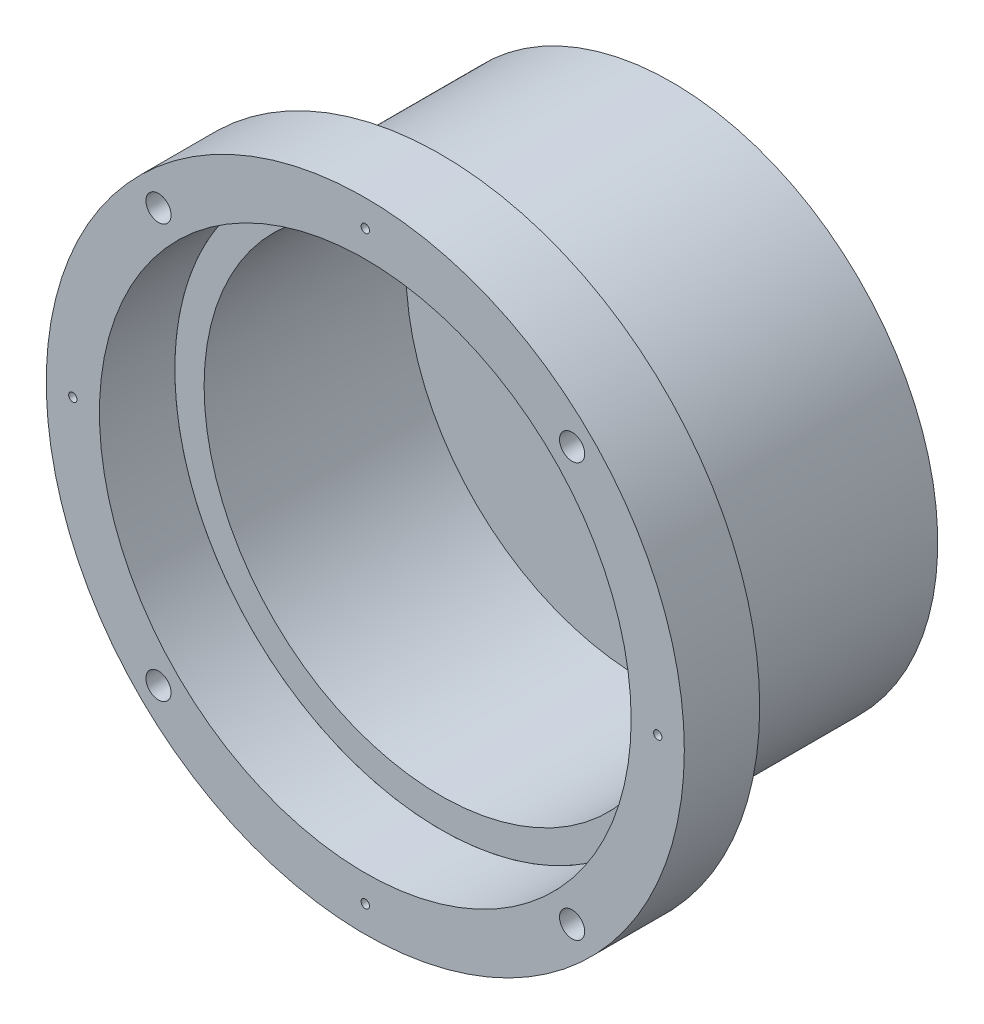
ISO-10303-21;
HEADER;
FILE_DESCRIPTION(('STEP AP214'),'2;1');
FILE_NAME('part.step','',(''),(''),'','','');
FILE_SCHEMA(('AUTOMOTIVE_DESIGN { 1 0 10303 214 1 1 1 1 }'));
ENDSEC;
DATA;
#1=APPLICATION_CONTEXT('core data for automotive mechanical design processes');
#2=APPLICATION_PROTOCOL_DEFINITION('international standard','automotive_design',2000,#1);
#3=PRODUCT_CONTEXT('',#1,'mechanical');
#4=PRODUCT('Part','Part','',(#3));
#5=PRODUCT_RELATED_PRODUCT_CATEGORY('part','',(#4));
#6=PRODUCT_DEFINITION_FORMATION('','',#4);
#7=PRODUCT_DEFINITION_CONTEXT('part definition',#1,'design');
#8=PRODUCT_DEFINITION('design','',#6,#7);
#9=PRODUCT_DEFINITION_SHAPE('','',#8);
#10=(LENGTH_UNIT() NAMED_UNIT(*) SI_UNIT(.MILLI.,.METRE.));
#11=(NAMED_UNIT(*) PLANE_ANGLE_UNIT() SI_UNIT($,.RADIAN.));
#12=(NAMED_UNIT(*) SI_UNIT($,.STERADIAN.) SOLID_ANGLE_UNIT());
#13=UNCERTAINTY_MEASURE_WITH_UNIT(LENGTH_MEASURE(1.E-05),#10,'distance_accuracy_value','');
#14=(GEOMETRIC_REPRESENTATION_CONTEXT(3) GLOBAL_UNCERTAINTY_ASSIGNED_CONTEXT((#13)) GLOBAL_UNIT_ASSIGNED_CONTEXT((#10,
#11,#12)) REPRESENTATION_CONTEXT('',''));
#15=CARTESIAN_POINT('',(0.,0.,0.));
#16=DIRECTION('',(0.,0.,1.));
#17=DIRECTION('',(1.,0.,0.));
#18=AXIS2_PLACEMENT_3D('',#15,#16,#17);
#19=CARTESIAN_POINT('',(0.,0.,-55.225));
#20=DIRECTION('',(0.,0.,1.));
#21=DIRECTION('',(1.,0.,0.));
#22=AXIS2_PLACEMENT_3D('',#19,#20,#21);
#23=CYLINDRICAL_SURFACE('',#22,56.5);
#24=CARTESIAN_POINT('',(0.,0.,0.));
#25=DIRECTION('',(0.,0.,-1.));
#26=DIRECTION('',(-1.,0.,0.));
#27=AXIS2_PLACEMENT_3D('',#24,#25,#26);
#28=CIRCLE('',#27,56.5);
#29=CARTESIAN_POINT('',(-56.5,0.,0.));
#30=VERTEX_POINT('',#29);
#31=EDGE_CURVE('E50',#30,#30,#28,.T.);
#32=ORIENTED_EDGE('',*,*,#31,.F.);
#33=EDGE_LOOP('',(#32));
#34=FACE_BOUND('',#33,.T.);
#35=CARTESIAN_POINT('',(0.,0.,-48.225));
#36=DIRECTION('',(0.,0.,-1.));
#37=DIRECTION('',(-1.,0.,0.));
#38=AXIS2_PLACEMENT_3D('',#35,#36,#37);
#39=CIRCLE('',#38,56.5);
#40=CARTESIAN_POINT('',(-56.5,0.,-48.225));
#41=VERTEX_POINT('',#40);
#42=EDGE_CURVE('E54',#41,#41,#39,.T.);
#43=ORIENTED_EDGE('',*,*,#42,.T.);
#44=EDGE_LOOP('',(#43));
#45=FACE_BOUND('',#44,.T.);
#46=ADVANCED_FACE('F39',(#34,#45),#23,.F.);
#47=CARTESIAN_POINT('',(0.,0.,-55.225));
#48=DIRECTION('',(0.,0.,-1.));
#49=DIRECTION('',(-1.,0.,0.));
#50=AXIS2_PLACEMENT_3D('',#47,#48,#49);
#51=PLANE('',#50);
#52=CARTESIAN_POINT('',(0.,0.,-55.225));
#53=DIRECTION('',(0.,0.,-1.));
#54=DIRECTION('',(-1.,0.,0.));
#55=AXIS2_PLACEMENT_3D('',#52,#53,#54);
#56=CIRCLE('',#55,63.5);
#57=CARTESIAN_POINT('',(-63.5,0.,-55.225));
#58=VERTEX_POINT('',#57);
#59=EDGE_CURVE('E11',#58,#58,#56,.T.);
#60=ORIENTED_EDGE('',*,*,#59,.T.);
#61=EDGE_LOOP('',(#60));
#62=FACE_BOUND('',#61,.T.);
#63=ADVANCED_FACE('F69',(#62),#51,.T.);
#64=CARTESIAN_POINT('',(0.,0.,0.));
#65=DIRECTION('',(0.,0.,-1.));
#66=DIRECTION('',(-1.,0.,0.));
#67=AXIS2_PLACEMENT_3D('',#64,#65,#66);
#68=PLANE('',#67);
#69=CARTESIAN_POINT('',(0.,0.,0.));
#70=DIRECTION('',(0.,0.,-1.));
#71=DIRECTION('',(-1.,0.,0.));
#72=AXIS2_PLACEMENT_3D('',#69,#70,#71);
#73=CIRCLE('',#72,63.5);
#74=CARTESIAN_POINT('',(-63.5,0.,0.));
#75=VERTEX_POINT('',#74);
#76=EDGE_CURVE('E43',#75,#75,#73,.T.);
#77=ORIENTED_EDGE('',*,*,#76,.F.);
#78=EDGE_LOOP('',(#77));
#79=FACE_BOUND('',#78,.T.);
#80=ORIENTED_EDGE('',*,*,#31,.T.);
#81=EDGE_LOOP('',(#80));
#82=FACE_BOUND('',#81,.T.);
#83=ADVANCED_FACE('F65',(#79,#82),#68,.F.);
#84=CARTESIAN_POINT('',(0.,0.,-55.225));
#85=DIRECTION('',(0.,0.,1.));
#86=DIRECTION('',(1.,0.,0.));
#87=AXIS2_PLACEMENT_3D('',#84,#85,#86);
#88=CYLINDRICAL_SURFACE('',#87,63.5);
#89=ORIENTED_EDGE('',*,*,#59,.F.);
#90=EDGE_LOOP('',(#89));
#91=FACE_BOUND('',#90,.T.);
#92=ORIENTED_EDGE('',*,*,#76,.T.);
#93=EDGE_LOOP('',(#92));
#94=FACE_BOUND('',#93,.T.);
#95=ADVANCED_FACE('F41',(#91,#94),#88,.T.);
#96=CARTESIAN_POINT('',(0.,0.,-48.225));
#97=DIRECTION('',(0.,0.,-1.));
#98=DIRECTION('',(-1.,0.,0.));
#99=AXIS2_PLACEMENT_3D('',#96,#97,#98);
#100=PLANE('',#99);
#101=ORIENTED_EDGE('',*,*,#42,.F.);
#102=EDGE_LOOP('',(#101));
#103=FACE_BOUND('',#102,.T.);
#104=ADVANCED_FACE('F59',(#103),#100,.F.);
#105=CLOSED_SHELL('',(#46,#63,#83,#95,#104));
#106=MANIFOLD_SOLID_BREP('B2',#105);
#107=CARTESIAN_POINT('',(0.,0.,28.225));
#108=DIRECTION('',(0.,0.,-1.));
#109=DIRECTION('',(-1.,0.,0.));
#110=AXIS2_PLACEMENT_3D('',#107,#108,#109);
#111=CYLINDRICAL_SURFACE('',#110,76.2);
#112=CARTESIAN_POINT('',(0.,0.,0.));
#113=DIRECTION('',(0.,0.,1.));
#114=DIRECTION('',(1.,0.,0.));
#115=AXIS2_PLACEMENT_3D('',#112,#113,#114);
#116=CIRCLE('',#115,76.2);
#117=CARTESIAN_POINT('',(76.2,0.,0.));
#118=VERTEX_POINT('',#117);
#119=EDGE_CURVE('E38',#118,#118,#116,.T.);
#120=ORIENTED_EDGE('',*,*,#119,.T.);
#121=EDGE_LOOP('',(#120));
#122=FACE_BOUND('',#121,.T.);
#123=CARTESIAN_POINT('',(0.,0.,18.));
#124=DIRECTION('',(0.,0.,1.));
#125=DIRECTION('',(1.,0.,0.));
#126=AXIS2_PLACEMENT_3D('',#123,#124,#125);
#127=CIRCLE('',#126,76.2);
#128=CARTESIAN_POINT('',(76.2,0.,18.));
#129=VERTEX_POINT('',#128);
#130=EDGE_CURVE('E168',#129,#129,#127,.T.);
#131=ORIENTED_EDGE('',*,*,#130,.F.);
#132=EDGE_LOOP('',(#131));
#133=FACE_BOUND('',#132,.T.);
#134=ADVANCED_FACE('F112',(#122,#133),#111,.T.);
#135=CARTESIAN_POINT('',(0.,0.,28.225));
#136=DIRECTION('',(0.,0.,-1.));
#137=DIRECTION('',(-1.,0.,0.));
#138=AXIS2_PLACEMENT_3D('',#135,#136,#137);
#139=CYLINDRICAL_SURFACE('',#138,63.5);
#140=CARTESIAN_POINT('',(0.,0.,0.));
#141=DIRECTION('',(0.,0.,1.));
#142=DIRECTION('',(1.,0.,0.));
#143=AXIS2_PLACEMENT_3D('',#140,#141,#142);
#144=CIRCLE('',#143,63.5);
#145=CARTESIAN_POINT('',(63.5,0.,0.));
#146=VERTEX_POINT('',#145);
#147=EDGE_CURVE('E119',#146,#146,#144,.T.);
#148=ORIENTED_EDGE('',*,*,#147,.F.);
#149=EDGE_LOOP('',(#148));
#150=FACE_BOUND('',#149,.T.);
#151=CARTESIAN_POINT('',(0.,0.,18.));
#152=DIRECTION('',(0.,0.,1.));
#153=DIRECTION('',(1.,0.,0.));
#154=AXIS2_PLACEMENT_3D('',#151,#152,#153);
#155=CIRCLE('',#154,63.5);
#156=CARTESIAN_POINT('',(63.5,0.,18.));
#157=VERTEX_POINT('',#156);
#158=EDGE_CURVE('E165',#157,#157,#155,.T.);
#159=ORIENTED_EDGE('',*,*,#158,.T.);
#160=EDGE_LOOP('',(#159));
#161=FACE_BOUND('',#160,.T.);
#162=ADVANCED_FACE('F189',(#150,#161),#139,.F.);
#163=CARTESIAN_POINT('',(-49.3914086658801,49.3914086658806,0.));
#164=DIRECTION('',(0.,0.,1.));
#165=DIRECTION('',(1.,0.,0.));
#166=AXIS2_PLACEMENT_3D('',#163,#164,#165);
#167=CYLINDRICAL_SURFACE('',#166,3.);
#168=CARTESIAN_POINT('',(-49.3914086658801,49.3914086658806,0.));
#169=DIRECTION('',(0.,0.,1.));
#170=DIRECTION('',(1.,0.,0.));
#171=AXIS2_PLACEMENT_3D('',#168,#169,#170);
#172=CIRCLE('',#171,3.);
#173=CARTESIAN_POINT('',(-46.3914086658801,49.3914086658806,0.));
#174=VERTEX_POINT('',#173);
#175=EDGE_CURVE('E124',#174,#174,#172,.T.);
#176=ORIENTED_EDGE('',*,*,#175,.F.);
#177=EDGE_LOOP('',(#176));
#178=FACE_BOUND('',#177,.T.);
#179=CARTESIAN_POINT('',(-49.3914086658801,49.3914086658806,18.));
#180=DIRECTION('',(0.,0.,1.));
#181=DIRECTION('',(1.,0.,0.));
#182=AXIS2_PLACEMENT_3D('',#179,#180,#181);
#183=CIRCLE('',#182,3.);
#184=CARTESIAN_POINT('',(-46.3914086658801,49.3914086658806,18.));
#185=VERTEX_POINT('',#184);
#186=EDGE_CURVE('E162',#185,#185,#183,.F.);
#187=ORIENTED_EDGE('',*,*,#186,.F.);
#188=EDGE_LOOP('',(#187));
#189=FACE_BOUND('',#188,.T.);
#190=ADVANCED_FACE('F185',(#178,#189),#167,.F.);
#191=CARTESIAN_POINT('',(49.3914086658806,49.3914086658829,0.));
#192=DIRECTION('',(0.,0.,1.));
#193=DIRECTION('',(1.,0.,0.));
#194=AXIS2_PLACEMENT_3D('',#191,#192,#193);
#195=CYLINDRICAL_SURFACE('',#194,3.00000000000287);
#196=CARTESIAN_POINT('',(49.3914086658806,49.3914086658829,0.));
#197=DIRECTION('',(0.,0.,1.));
#198=DIRECTION('',(1.,0.,0.));
#199=AXIS2_PLACEMENT_3D('',#196,#197,#198);
#200=CIRCLE('',#199,3.00000000000287);
#201=CARTESIAN_POINT('',(52.3914086658835,49.3914086658829,0.));
#202=VERTEX_POINT('',#201);
#203=EDGE_CURVE('E172',#202,#202,#200,.T.);
#204=ORIENTED_EDGE('',*,*,#203,.F.);
#205=EDGE_LOOP('',(#204));
#206=FACE_BOUND('',#205,.T.);
#207=CARTESIAN_POINT('',(49.3914086658806,49.3914086658829,18.));
#208=DIRECTION('',(0.,0.,1.));
#209=DIRECTION('',(1.,0.,0.));
#210=AXIS2_PLACEMENT_3D('',#207,#208,#209);
#211=CIRCLE('',#210,3.00000000000287);
#212=CARTESIAN_POINT('',(52.3914086658835,49.3914086658829,18.));
#213=VERTEX_POINT('',#212);
#214=EDGE_CURVE('E159',#213,#213,#211,.F.);
#215=ORIENTED_EDGE('',*,*,#214,.F.);
#216=EDGE_LOOP('',(#215));
#217=FACE_BOUND('',#216,.T.);
#218=ADVANCED_FACE('F188',(#206,#217),#195,.F.);
#219=CARTESIAN_POINT('',(49.3914086658829,-49.3914086658779,0.));
#220=DIRECTION('',(0.,0.,1.));
#221=DIRECTION('',(1.,0.,0.));
#222=AXIS2_PLACEMENT_3D('',#219,#220,#221);
#223=CYLINDRICAL_SURFACE('',#222,3.00000000000392);
#224=CARTESIAN_POINT('',(49.3914086658829,-49.3914086658779,0.));
#225=DIRECTION('',(0.,0.,1.));
#226=DIRECTION('',(1.,0.,0.));
#227=AXIS2_PLACEMENT_3D('',#224,#225,#226);
#228=CIRCLE('',#227,3.00000000000392);
#229=CARTESIAN_POINT('',(52.3914086658868,-49.3914086658779,0.));
#230=VERTEX_POINT('',#229);
#231=EDGE_CURVE('E175',#230,#230,#228,.T.);
#232=ORIENTED_EDGE('',*,*,#231,.F.);
#233=EDGE_LOOP('',(#232));
#234=FACE_BOUND('',#233,.T.);
#235=CARTESIAN_POINT('',(49.3914086658829,-49.3914086658779,18.));
#236=DIRECTION('',(0.,0.,1.));
#237=DIRECTION('',(1.,0.,0.));
#238=AXIS2_PLACEMENT_3D('',#235,#236,#237);
#239=CIRCLE('',#238,3.00000000000392);
#240=CARTESIAN_POINT('',(52.3914086658868,-49.3914086658779,18.));
#241=VERTEX_POINT('',#240);
#242=EDGE_CURVE('E131',#241,#241,#239,.F.);
#243=ORIENTED_EDGE('',*,*,#242,.F.);
#244=EDGE_LOOP('',(#243));
#245=FACE_BOUND('',#244,.T.);
#246=ADVANCED_FACE('F227',(#234,#245),#223,.F.);
#247=CARTESIAN_POINT('',(-49.3914086658778,-49.3914086658801,0.));
#248=DIRECTION('',(0.,0.,1.));
#249=DIRECTION('',(1.,0.,0.));
#250=AXIS2_PLACEMENT_3D('',#247,#248,#249);
#251=CYLINDRICAL_SURFACE('',#250,3.0000000000015);
#252=CARTESIAN_POINT('',(-49.3914086658778,-49.3914086658801,0.));
#253=DIRECTION('',(0.,0.,1.));
#254=DIRECTION('',(1.,0.,0.));
#255=AXIS2_PLACEMENT_3D('',#252,#253,#254);
#256=CIRCLE('',#255,3.0000000000015);
#257=CARTESIAN_POINT('',(-46.3914086658763,-49.3914086658801,0.));
#258=VERTEX_POINT('',#257);
#259=EDGE_CURVE('E171',#258,#258,#256,.T.);
#260=ORIENTED_EDGE('',*,*,#259,.F.);
#261=EDGE_LOOP('',(#260));
#262=FACE_BOUND('',#261,.T.);
#263=CARTESIAN_POINT('',(-49.3914086658778,-49.3914086658801,18.));
#264=DIRECTION('',(0.,0.,1.));
#265=DIRECTION('',(1.,0.,0.));
#266=AXIS2_PLACEMENT_3D('',#263,#264,#265);
#267=CIRCLE('',#266,3.0000000000015);
#268=CARTESIAN_POINT('',(-46.3914086658763,-49.3914086658801,18.));
#269=VERTEX_POINT('',#268);
#270=EDGE_CURVE('E128',#269,#269,#267,.F.);
#271=ORIENTED_EDGE('',*,*,#270,.F.);
#272=EDGE_LOOP('',(#271));
#273=FACE_BOUND('',#272,.T.);
#274=ADVANCED_FACE('F221',(#262,#273),#251,.F.);
#275=CARTESIAN_POINT('',(0.,0.,0.));
#276=DIRECTION('',(0.,0.,1.));
#277=DIRECTION('',(1.,0.,0.));
#278=AXIS2_PLACEMENT_3D('',#275,#276,#277);
#279=PLANE('',#278);
#280=CARTESIAN_POINT('',(0.,69.85,0.));
#281=DIRECTION('',(0.,0.,-1.));
#282=DIRECTION('',(-1.,0.,0.));
#283=AXIS2_PLACEMENT_3D('',#280,#281,#282);
#284=CIRCLE('',#283,2.);
#285=CARTESIAN_POINT('',(-2.,69.85,0.));
#286=VERTEX_POINT('',#285);
#287=EDGE_CURVE('E232',#286,#286,#284,.T.);
#288=ORIENTED_EDGE('',*,*,#287,.F.);
#289=EDGE_LOOP('',(#288));
#290=FACE_BOUND('',#289,.T.);
#291=CARTESIAN_POINT('',(-69.850000000002,1.97242516687565E-12,0.));
#292=DIRECTION('',(0.,0.,-1.));
#293=DIRECTION('',(-1.,0.,0.));
#294=AXIS2_PLACEMENT_3D('',#291,#292,#293);
#295=CIRCLE('',#294,2.00000000000154);
#296=CARTESIAN_POINT('',(-71.8500000000035,1.97242516687565E-12,0.));
#297=VERTEX_POINT('',#296);
#298=EDGE_CURVE('E236',#297,#297,#295,.T.);
#299=ORIENTED_EDGE('',*,*,#298,.F.);
#300=EDGE_LOOP('',(#299));
#301=FACE_BOUND('',#300,.T.);
#302=CARTESIAN_POINT('',(-3.94562798446877E-12,-69.85,0.));
#303=DIRECTION('',(0.,0.,-1.));
#304=DIRECTION('',(-1.,0.,0.));
#305=AXIS2_PLACEMENT_3D('',#302,#303,#304);
#306=CIRCLE('',#305,2.00000000000424);
#307=CARTESIAN_POINT('',(-2.00000000000819,-69.85,0.));
#308=VERTEX_POINT('',#307);
#309=EDGE_CURVE('E153',#308,#308,#306,.T.);
#310=ORIENTED_EDGE('',*,*,#309,.F.);
#311=EDGE_LOOP('',(#310));
#312=FACE_BOUND('',#311,.T.);
#313=CARTESIAN_POINT('',(69.849999999998,-1.9809793247677E-12,0.));
#314=DIRECTION('',(0.,0.,-1.));
#315=DIRECTION('',(-1.,0.,0.));
#316=AXIS2_PLACEMENT_3D('',#313,#314,#315);
#317=CIRCLE('',#316,2.00000000000318);
#318=CARTESIAN_POINT('',(67.8499999999948,-1.9809793247677E-12,0.));
#319=VERTEX_POINT('',#318);
#320=EDGE_CURVE('E144',#319,#319,#317,.T.);
#321=ORIENTED_EDGE('',*,*,#320,.F.);
#322=EDGE_LOOP('',(#321));
#323=FACE_BOUND('',#322,.T.);
#324=ORIENTED_EDGE('',*,*,#259,.T.);
#325=EDGE_LOOP('',(#324));
#326=FACE_BOUND('',#325,.T.);
#327=ORIENTED_EDGE('',*,*,#231,.T.);
#328=EDGE_LOOP('',(#327));
#329=FACE_BOUND('',#328,.T.);
#330=ORIENTED_EDGE('',*,*,#203,.T.);
#331=EDGE_LOOP('',(#330));
#332=FACE_BOUND('',#331,.T.);
#333=ORIENTED_EDGE('',*,*,#175,.T.);
#334=EDGE_LOOP('',(#333));
#335=FACE_BOUND('',#334,.T.);
#336=ORIENTED_EDGE('',*,*,#119,.F.);
#337=EDGE_LOOP('',(#336));
#338=FACE_BOUND('',#337,.T.);
#339=ORIENTED_EDGE('',*,*,#147,.T.);
#340=EDGE_LOOP('',(#339));
#341=FACE_BOUND('',#340,.T.);
#342=ADVANCED_FACE('F182',(#290,#301,#312,#323,#326,#329,#332,#335,#338,#341),#279,.F.);
#343=CARTESIAN_POINT('',(0.,0.,18.));
#344=DIRECTION('',(0.,0.,1.));
#345=DIRECTION('',(1.,0.,0.));
#346=AXIS2_PLACEMENT_3D('',#343,#344,#345);
#347=PLANE('',#346);
#348=CARTESIAN_POINT('',(0.,69.85,18.));
#349=DIRECTION('',(0.,0.,-1.));
#350=DIRECTION('',(-1.,0.,0.));
#351=AXIS2_PLACEMENT_3D('',#348,#349,#350);
#352=CIRCLE('',#351,1.);
#353=CARTESIAN_POINT('',(-1.,69.85,18.));
#354=VERTEX_POINT('',#353);
#355=EDGE_CURVE('E137',#354,#354,#352,.T.);
#356=ORIENTED_EDGE('',*,*,#355,.T.);
#357=EDGE_LOOP('',(#356));
#358=FACE_BOUND('',#357,.T.);
#359=CARTESIAN_POINT('',(-69.850000000002,1.97242516687565E-12,18.));
#360=DIRECTION('',(0.,0.,-1.));
#361=DIRECTION('',(-1.,0.,0.));
#362=AXIS2_PLACEMENT_3D('',#359,#360,#361);
#363=CIRCLE('',#362,1.00000000000154);
#364=CARTESIAN_POINT('',(-70.8500000000035,1.97242516687565E-12,18.));
#365=VERTEX_POINT('',#364);
#366=EDGE_CURVE('E306',#365,#365,#363,.T.);
#367=ORIENTED_EDGE('',*,*,#366,.T.);
#368=EDGE_LOOP('',(#367));
#369=FACE_BOUND('',#368,.T.);
#370=CARTESIAN_POINT('',(-3.94562798446877E-12,-69.85,18.));
#371=DIRECTION('',(0.,0.,-1.));
#372=DIRECTION('',(-1.,0.,0.));
#373=AXIS2_PLACEMENT_3D('',#370,#371,#372);
#374=CIRCLE('',#373,1.00000000000424);
#375=CARTESIAN_POINT('',(-1.00000000000819,-69.85,18.));
#376=VERTEX_POINT('',#375);
#377=EDGE_CURVE('E309',#376,#376,#374,.T.);
#378=ORIENTED_EDGE('',*,*,#377,.T.);
#379=EDGE_LOOP('',(#378));
#380=FACE_BOUND('',#379,.T.);
#381=CARTESIAN_POINT('',(69.849999999998,-1.9809793247677E-12,18.));
#382=DIRECTION('',(0.,0.,-1.));
#383=DIRECTION('',(-1.,0.,0.));
#384=AXIS2_PLACEMENT_3D('',#381,#382,#383);
#385=CIRCLE('',#384,1.00000000000317);
#386=CARTESIAN_POINT('',(68.8499999999948,-1.9809793247677E-12,18.));
#387=VERTEX_POINT('',#386);
#388=EDGE_CURVE('E314',#387,#387,#385,.T.);
#389=ORIENTED_EDGE('',*,*,#388,.T.);
#390=EDGE_LOOP('',(#389));
#391=FACE_BOUND('',#390,.T.);
#392=ORIENTED_EDGE('',*,*,#186,.T.);
#393=EDGE_LOOP('',(#392));
#394=FACE_BOUND('',#393,.T.);
#395=ORIENTED_EDGE('',*,*,#214,.T.);
#396=EDGE_LOOP('',(#395));
#397=FACE_BOUND('',#396,.T.);
#398=ORIENTED_EDGE('',*,*,#242,.T.);
#399=EDGE_LOOP('',(#398));
#400=FACE_BOUND('',#399,.T.);
#401=ORIENTED_EDGE('',*,*,#270,.T.);
#402=EDGE_LOOP('',(#401));
#403=FACE_BOUND('',#402,.T.);
#404=ORIENTED_EDGE('',*,*,#158,.F.);
#405=EDGE_LOOP('',(#404));
#406=FACE_BOUND('',#405,.T.);
#407=ORIENTED_EDGE('',*,*,#130,.T.);
#408=EDGE_LOOP('',(#407));
#409=FACE_BOUND('',#408,.T.);
#410=ADVANCED_FACE('F193',(#358,#369,#380,#391,#394,#397,#400,#403,#406,#409),#347,.T.);
#411=CARTESIAN_POINT('',(69.849999999998,-1.9809793247677E-12,10.));
#412=DIRECTION('',(0.,0.,-1.));
#413=DIRECTION('',(-1.,0.,0.));
#414=AXIS2_PLACEMENT_3D('',#411,#412,#413);
#415=CYLINDRICAL_SURFACE('',#414,2.00000000000318);
#416=CARTESIAN_POINT('',(69.849999999998,-1.9809793247677E-12,10.));
#417=DIRECTION('',(0.,0.,-1.));
#418=DIRECTION('',(-1.,0.,0.));
#419=AXIS2_PLACEMENT_3D('',#416,#417,#418);
#420=CIRCLE('',#419,2.00000000000318);
#421=CARTESIAN_POINT('',(67.8499999999948,-1.9809793247677E-12,10.));
#422=VERTEX_POINT('',#421);
#423=EDGE_CURVE('E148',#422,#422,#420,.T.);
#424=ORIENTED_EDGE('',*,*,#423,.F.);
#425=EDGE_LOOP('',(#424));
#426=FACE_BOUND('',#425,.T.);
#427=ORIENTED_EDGE('',*,*,#320,.T.);
#428=EDGE_LOOP('',(#427));
#429=FACE_BOUND('',#428,.T.);
#430=ADVANCED_FACE('F196',(#426,#429),#415,.F.);
#431=CARTESIAN_POINT('',(69.849999999998,-1.9809793247677E-12,10.));
#432=DIRECTION('',(0.,0.,-1.));
#433=DIRECTION('',(-1.,0.,0.));
#434=AXIS2_PLACEMENT_3D('',#431,#432,#433);
#435=PLANE('',#434);
#436=CARTESIAN_POINT('',(69.849999999998,-1.9809793247677E-12,10.));
#437=DIRECTION('',(0.,0.,-1.));
#438=DIRECTION('',(-1.,0.,0.));
#439=AXIS2_PLACEMENT_3D('',#436,#437,#438);
#440=CIRCLE('',#439,1.00000000000317);
#441=CARTESIAN_POINT('',(68.8499999999948,-1.9809793247677E-12,10.));
#442=VERTEX_POINT('',#441);
#443=EDGE_CURVE('E115',#442,#442,#440,.T.);
#444=ORIENTED_EDGE('',*,*,#443,.F.);
#445=EDGE_LOOP('',(#444));
#446=FACE_BOUND('',#445,.T.);
#447=ORIENTED_EDGE('',*,*,#423,.T.);
#448=EDGE_LOOP('',(#447));
#449=FACE_BOUND('',#448,.T.);
#450=ADVANCED_FACE('F258',(#446,#449),#435,.T.);
#451=CARTESIAN_POINT('',(-3.94562798446877E-12,-69.85,10.));
#452=DIRECTION('',(0.,0.,-1.));
#453=DIRECTION('',(-1.,0.,0.));
#454=AXIS2_PLACEMENT_3D('',#451,#452,#453);
#455=CYLINDRICAL_SURFACE('',#454,2.00000000000424);
#456=CARTESIAN_POINT('',(-3.94562798446877E-12,-69.85,10.));
#457=DIRECTION('',(0.,0.,-1.));
#458=DIRECTION('',(-1.,0.,0.));
#459=AXIS2_PLACEMENT_3D('',#456,#457,#458);
#460=CIRCLE('',#459,2.00000000000424);
#461=CARTESIAN_POINT('',(-2.00000000000819,-69.85,10.));
#462=VERTEX_POINT('',#461);
#463=EDGE_CURVE('E324',#462,#462,#460,.T.);
#464=ORIENTED_EDGE('',*,*,#463,.F.);
#465=EDGE_LOOP('',(#464));
#466=FACE_BOUND('',#465,.T.);
#467=ORIENTED_EDGE('',*,*,#309,.T.);
#468=EDGE_LOOP('',(#467));
#469=FACE_BOUND('',#468,.T.);
#470=ADVANCED_FACE('F262',(#466,#469),#455,.F.);
#471=CARTESIAN_POINT('',(-3.94562798446877E-12,-69.85,10.));
#472=DIRECTION('',(0.,0.,-1.));
#473=DIRECTION('',(-1.,0.,0.));
#474=AXIS2_PLACEMENT_3D('',#471,#472,#473);
#475=PLANE('',#474);
#476=CARTESIAN_POINT('',(-3.94562798446877E-12,-69.85,10.));
#477=DIRECTION('',(0.,0.,-1.));
#478=DIRECTION('',(-1.,0.,0.));
#479=AXIS2_PLACEMENT_3D('',#476,#477,#478);
#480=CIRCLE('',#479,1.00000000000424);
#481=CARTESIAN_POINT('',(-1.00000000000819,-69.85,10.));
#482=VERTEX_POINT('',#481);
#483=EDGE_CURVE('E139',#482,#482,#480,.T.);
#484=ORIENTED_EDGE('',*,*,#483,.F.);
#485=EDGE_LOOP('',(#484));
#486=FACE_BOUND('',#485,.T.);
#487=ORIENTED_EDGE('',*,*,#463,.T.);
#488=EDGE_LOOP('',(#487));
#489=FACE_BOUND('',#488,.T.);
#490=ADVANCED_FACE('F266',(#486,#489),#475,.T.);
#491=CARTESIAN_POINT('',(-69.850000000002,1.97242516687565E-12,10.));
#492=DIRECTION('',(0.,0.,-1.));
#493=DIRECTION('',(-1.,0.,0.));
#494=AXIS2_PLACEMENT_3D('',#491,#492,#493);
#495=CYLINDRICAL_SURFACE('',#494,2.00000000000154);
#496=CARTESIAN_POINT('',(-69.850000000002,1.97242516687565E-12,10.));
#497=DIRECTION('',(0.,0.,-1.));
#498=DIRECTION('',(-1.,0.,0.));
#499=AXIS2_PLACEMENT_3D('',#496,#497,#498);
#500=CIRCLE('',#499,2.00000000000154);
#501=CARTESIAN_POINT('',(-71.8500000000035,1.97242516687565E-12,10.));
#502=VERTEX_POINT('',#501);
#503=EDGE_CURVE('E320',#502,#502,#500,.T.);
#504=ORIENTED_EDGE('',*,*,#503,.F.);
#505=EDGE_LOOP('',(#504));
#506=FACE_BOUND('',#505,.T.);
#507=ORIENTED_EDGE('',*,*,#298,.T.);
#508=EDGE_LOOP('',(#507));
#509=FACE_BOUND('',#508,.T.);
#510=ADVANCED_FACE('F270',(#506,#509),#495,.F.);
#511=CARTESIAN_POINT('',(-69.850000000002,1.97242516687565E-12,10.));
#512=DIRECTION('',(0.,0.,-1.));
#513=DIRECTION('',(-1.,0.,0.));
#514=AXIS2_PLACEMENT_3D('',#511,#512,#513);
#515=PLANE('',#514);
#516=CARTESIAN_POINT('',(-69.850000000002,1.97242516687565E-12,10.));
#517=DIRECTION('',(0.,0.,-1.));
#518=DIRECTION('',(-1.,0.,0.));
#519=AXIS2_PLACEMENT_3D('',#516,#517,#518);
#520=CIRCLE('',#519,1.00000000000154);
#521=CARTESIAN_POINT('',(-70.8500000000035,1.97242516687565E-12,10.));
#522=VERTEX_POINT('',#521);
#523=EDGE_CURVE('E136',#522,#522,#520,.T.);
#524=ORIENTED_EDGE('',*,*,#523,.F.);
#525=EDGE_LOOP('',(#524));
#526=FACE_BOUND('',#525,.T.);
#527=ORIENTED_EDGE('',*,*,#503,.T.);
#528=EDGE_LOOP('',(#527));
#529=FACE_BOUND('',#528,.T.);
#530=ADVANCED_FACE('F274',(#526,#529),#515,.T.);
#531=CARTESIAN_POINT('',(0.,69.85,10.));
#532=DIRECTION('',(0.,0.,-1.));
#533=DIRECTION('',(-1.,0.,0.));
#534=AXIS2_PLACEMENT_3D('',#531,#532,#533);
#535=CYLINDRICAL_SURFACE('',#534,2.);
#536=CARTESIAN_POINT('',(0.,69.85,10.));
#537=DIRECTION('',(0.,0.,-1.));
#538=DIRECTION('',(-1.,0.,0.));
#539=AXIS2_PLACEMENT_3D('',#536,#537,#538);
#540=CIRCLE('',#539,2.);
#541=CARTESIAN_POINT('',(-2.,69.85,10.));
#542=VERTEX_POINT('',#541);
#543=EDGE_CURVE('E132',#542,#542,#540,.T.);
#544=ORIENTED_EDGE('',*,*,#543,.F.);
#545=EDGE_LOOP('',(#544));
#546=FACE_BOUND('',#545,.T.);
#547=ORIENTED_EDGE('',*,*,#287,.T.);
#548=EDGE_LOOP('',(#547));
#549=FACE_BOUND('',#548,.T.);
#550=ADVANCED_FACE('F278',(#546,#549),#535,.F.);
#551=CARTESIAN_POINT('',(0.,69.85,10.));
#552=DIRECTION('',(0.,0.,-1.));
#553=DIRECTION('',(-1.,0.,0.));
#554=AXIS2_PLACEMENT_3D('',#551,#552,#553);
#555=PLANE('',#554);
#556=CARTESIAN_POINT('',(0.,69.85,10.));
#557=DIRECTION('',(0.,0.,-1.));
#558=DIRECTION('',(-1.,0.,0.));
#559=AXIS2_PLACEMENT_3D('',#556,#557,#558);
#560=CIRCLE('',#559,1.);
#561=CARTESIAN_POINT('',(-1.,69.85,10.));
#562=VERTEX_POINT('',#561);
#563=EDGE_CURVE('E133',#562,#562,#560,.T.);
#564=ORIENTED_EDGE('',*,*,#563,.F.);
#565=EDGE_LOOP('',(#564));
#566=FACE_BOUND('',#565,.T.);
#567=ORIENTED_EDGE('',*,*,#543,.T.);
#568=EDGE_LOOP('',(#567));
#569=FACE_BOUND('',#568,.T.);
#570=ADVANCED_FACE('F282',(#566,#569),#555,.T.);
#571=CARTESIAN_POINT('',(0.,69.85,18.));
#572=DIRECTION('',(0.,0.,-1.));
#573=DIRECTION('',(-1.,0.,0.));
#574=AXIS2_PLACEMENT_3D('',#571,#572,#573);
#575=CYLINDRICAL_SURFACE('',#574,1.);
#576=ORIENTED_EDGE('',*,*,#563,.T.);
#577=EDGE_LOOP('',(#576));
#578=FACE_BOUND('',#577,.T.);
#579=ORIENTED_EDGE('',*,*,#355,.F.);
#580=EDGE_LOOP('',(#579));
#581=FACE_BOUND('',#580,.T.);
#582=ADVANCED_FACE('F286',(#578,#581),#575,.F.);
#583=CARTESIAN_POINT('',(-69.850000000002,1.97242516687565E-12,18.));
#584=DIRECTION('',(0.,0.,-1.));
#585=DIRECTION('',(-1.,0.,0.));
#586=AXIS2_PLACEMENT_3D('',#583,#584,#585);
#587=CYLINDRICAL_SURFACE('',#586,1.00000000000154);
#588=ORIENTED_EDGE('',*,*,#523,.T.);
#589=EDGE_LOOP('',(#588));
#590=FACE_BOUND('',#589,.T.);
#591=ORIENTED_EDGE('',*,*,#366,.F.);
#592=EDGE_LOOP('',(#591));
#593=FACE_BOUND('',#592,.T.);
#594=ADVANCED_FACE('F294',(#590,#593),#587,.F.);
#595=CARTESIAN_POINT('',(-3.94562798446877E-12,-69.85,18.));
#596=DIRECTION('',(0.,0.,-1.));
#597=DIRECTION('',(-1.,0.,0.));
#598=AXIS2_PLACEMENT_3D('',#595,#596,#597);
#599=CYLINDRICAL_SURFACE('',#598,1.00000000000424);
#600=ORIENTED_EDGE('',*,*,#483,.T.);
#601=EDGE_LOOP('',(#600));
#602=FACE_BOUND('',#601,.T.);
#603=ORIENTED_EDGE('',*,*,#377,.F.);
#604=EDGE_LOOP('',(#603));
#605=FACE_BOUND('',#604,.T.);
#606=ADVANCED_FACE('F291',(#602,#605),#599,.F.);
#607=CARTESIAN_POINT('',(69.849999999998,-1.9809793247677E-12,18.));
#608=DIRECTION('',(0.,0.,-1.));
#609=DIRECTION('',(-1.,0.,0.));
#610=AXIS2_PLACEMENT_3D('',#607,#608,#609);
#611=CYLINDRICAL_SURFACE('',#610,1.00000000000317);
#612=ORIENTED_EDGE('',*,*,#443,.T.);
#613=EDGE_LOOP('',(#612));
#614=FACE_BOUND('',#613,.T.);
#615=ORIENTED_EDGE('',*,*,#388,.F.);
#616=EDGE_LOOP('',(#615));
#617=FACE_BOUND('',#616,.T.);
#618=ADVANCED_FACE('F288',(#614,#617),#611,.F.);
#619=CLOSED_SHELL('',(#134,#162,#190,#218,#246,#274,#342,#410,#430,#450,#470,#490,#510,#530,
#550,#570,#582,#594,#606,#618));
#620=MANIFOLD_SOLID_BREP('B6',#619);
#621=ADVANCED_BREP_SHAPE_REPRESENTATION('',(#18,#106,#620),#14);
#622=SHAPE_DEFINITION_REPRESENTATION(#9,#621);
ENDSEC;
END-ISO-10303-21;
